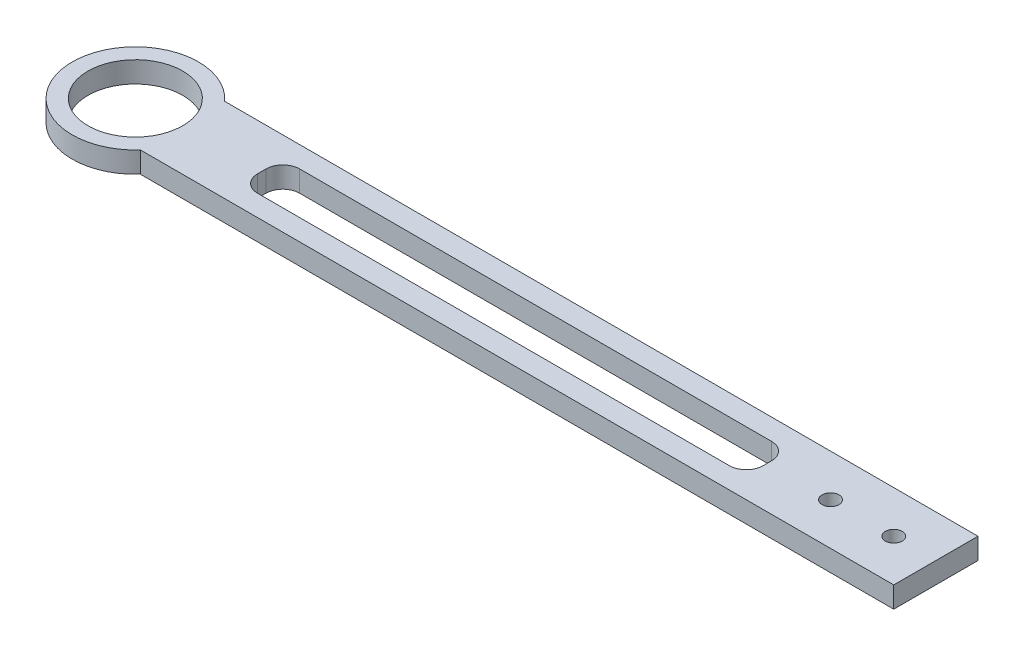
ISO-10303-21;
HEADER;
FILE_DESCRIPTION(('STEP AP214'),'2;1');
FILE_NAME('part.step','',(''),(''),'','','');
FILE_SCHEMA(('AUTOMOTIVE_DESIGN { 1 0 10303 214 1 1 1 1 }'));
ENDSEC;
DATA;
#1=APPLICATION_CONTEXT('core data for automotive mechanical design processes');
#2=APPLICATION_PROTOCOL_DEFINITION('international standard','automotive_design',2000,#1);
#3=PRODUCT_CONTEXT('',#1,'mechanical');
#4=PRODUCT('Part','Part','',(#3));
#5=PRODUCT_RELATED_PRODUCT_CATEGORY('part','',(#4));
#6=PRODUCT_DEFINITION_FORMATION('','',#4);
#7=PRODUCT_DEFINITION_CONTEXT('part definition',#1,'design');
#8=PRODUCT_DEFINITION('design','',#6,#7);
#9=PRODUCT_DEFINITION_SHAPE('','',#8);
#10=(LENGTH_UNIT() NAMED_UNIT(*) SI_UNIT(.MILLI.,.METRE.));
#11=(NAMED_UNIT(*) PLANE_ANGLE_UNIT() SI_UNIT($,.RADIAN.));
#12=(NAMED_UNIT(*) SI_UNIT($,.STERADIAN.) SOLID_ANGLE_UNIT());
#13=UNCERTAINTY_MEASURE_WITH_UNIT(LENGTH_MEASURE(1.E-05),#10,'distance_accuracy_value','');
#14=(GEOMETRIC_REPRESENTATION_CONTEXT(3) GLOBAL_UNCERTAINTY_ASSIGNED_CONTEXT((#13)) GLOBAL_UNIT_ASSIGNED_CONTEXT((#10,
#11,#12)) REPRESENTATION_CONTEXT('',''));
#15=CARTESIAN_POINT('',(0.,0.,0.));
#16=DIRECTION('',(0.,0.,1.));
#17=DIRECTION('',(1.,0.,0.));
#18=AXIS2_PLACEMENT_3D('',#15,#16,#17);
#19=CARTESIAN_POINT('',(127.,3.175,12.7));
#20=DIRECTION('',(-1.,0.,0.));
#21=DIRECTION('',(0.,0.,1.));
#22=AXIS2_PLACEMENT_3D('',#19,#20,#21);
#23=PLANE('',#22);
#24=DIRECTION('',(0.,0.,-1.));
#25=VECTOR('',#24,1.);
#26=CARTESIAN_POINT('',(127.,-3.175,12.7));
#27=LINE('',#26,#25);
#28=CARTESIAN_POINT('',(127.,-3.175,12.7));
#29=VERTEX_POINT('',#28);
#30=CARTESIAN_POINT('',(127.,-3.175,-12.7));
#31=VERTEX_POINT('',#30);
#32=EDGE_CURVE('E156',#29,#31,#27,.T.);
#33=ORIENTED_EDGE('',*,*,#32,.T.);
#34=DIRECTION('',(0.,-1.,0.));
#35=VECTOR('',#34,1.);
#36=CARTESIAN_POINT('',(127.,3.175,-12.7));
#37=LINE('',#36,#35);
#38=CARTESIAN_POINT('',(127.,3.175,-12.7));
#39=VERTEX_POINT('',#38);
#40=EDGE_CURVE('E150',#39,#31,#37,.T.);
#41=ORIENTED_EDGE('',*,*,#40,.F.);
#42=DIRECTION('',(0.,0.,-1.));
#43=VECTOR('',#42,1.);
#44=CARTESIAN_POINT('',(127.,3.175,12.7));
#45=LINE('',#44,#43);
#46=CARTESIAN_POINT('',(127.,3.175,12.7));
#47=VERTEX_POINT('',#46);
#48=EDGE_CURVE('E152',#47,#39,#45,.T.);
#49=ORIENTED_EDGE('',*,*,#48,.F.);
#50=DIRECTION('',(0.,-1.,0.));
#51=VECTOR('',#50,1.);
#52=CARTESIAN_POINT('',(127.,3.175,12.7));
#53=LINE('',#52,#51);
#54=EDGE_CURVE('E147',#47,#29,#53,.T.);
#55=ORIENTED_EDGE('',*,*,#54,.T.);
#56=EDGE_LOOP('',(#33,#41,#49,#55));
#57=FACE_BOUND('',#56,.T.);
#58=ADVANCED_FACE('F35',(#57),#23,.F.);
#59=CARTESIAN_POINT('',(-127.,3.175,-12.7));
#60=DIRECTION('',(0.,0.,1.));
#61=DIRECTION('',(1.,0.,0.));
#62=AXIS2_PLACEMENT_3D('',#59,#60,#61);
#63=PLANE('',#62);
#64=DIRECTION('',(-1.,0.,0.));
#65=VECTOR('',#64,1.);
#66=CARTESIAN_POINT('',(-127.,-3.175,-12.7));
#67=LINE('',#66,#65);
#68=CARTESIAN_POINT('',(-100.100968342876,-3.175,-12.7));
#69=VERTEX_POINT('',#68);
#70=EDGE_CURVE('E159',#31,#69,#67,.T.);
#71=ORIENTED_EDGE('',*,*,#70,.T.);
#72=DIRECTION('',(0.,-1.,0.));
#73=VECTOR('',#72,1.);
#74=CARTESIAN_POINT('',(-100.100968342876,57.0565367264149,-12.7));
#75=LINE('',#74,#73);
#76=CARTESIAN_POINT('',(-100.100968342876,3.175,-12.7));
#77=VERTEX_POINT('',#76);
#78=EDGE_CURVE('E134',#69,#77,#75,.F.);
#79=ORIENTED_EDGE('',*,*,#78,.T.);
#80=DIRECTION('',(-1.,0.,0.));
#81=VECTOR('',#80,1.);
#82=CARTESIAN_POINT('',(-127.,3.175,-12.7));
#83=LINE('',#82,#81);
#84=EDGE_CURVE('E143',#39,#77,#83,.T.);
#85=ORIENTED_EDGE('',*,*,#84,.F.);
#86=ORIENTED_EDGE('',*,*,#40,.T.);
#87=EDGE_LOOP('',(#71,#79,#85,#86));
#88=FACE_BOUND('',#87,.T.);
#89=ADVANCED_FACE('F248',(#88),#63,.F.);
#90=CARTESIAN_POINT('',(-127.,3.175,12.7));
#91=DIRECTION('',(0.,0.,-1.));
#92=DIRECTION('',(-1.,0.,0.));
#93=AXIS2_PLACEMENT_3D('',#90,#91,#92);
#94=PLANE('',#93);
#95=DIRECTION('',(1.,0.,0.));
#96=VECTOR('',#95,1.);
#97=CARTESIAN_POINT('',(-127.,3.175,12.7));
#98=LINE('',#97,#96);
#99=CARTESIAN_POINT('',(-100.100968342876,3.175,12.7));
#100=VERTEX_POINT('',#99);
#101=EDGE_CURVE('E141',#100,#47,#98,.T.);
#102=ORIENTED_EDGE('',*,*,#101,.F.);
#103=DIRECTION('',(0.,-1.,0.));
#104=VECTOR('',#103,1.);
#105=CARTESIAN_POINT('',(-100.100968342876,57.0565367264149,12.7));
#106=LINE('',#105,#104);
#107=CARTESIAN_POINT('',(-100.100968342876,-3.175,12.7));
#108=VERTEX_POINT('',#107);
#109=EDGE_CURVE('E124',#100,#108,#106,.T.);
#110=ORIENTED_EDGE('',*,*,#109,.T.);
#111=DIRECTION('',(1.,0.,0.));
#112=VECTOR('',#111,1.);
#113=CARTESIAN_POINT('',(-127.,-3.175,12.7));
#114=LINE('',#113,#112);
#115=EDGE_CURVE('E163',#108,#29,#114,.T.);
#116=ORIENTED_EDGE('',*,*,#115,.T.);
#117=ORIENTED_EDGE('',*,*,#54,.F.);
#118=EDGE_LOOP('',(#102,#110,#116,#117));
#119=FACE_BOUND('',#118,.T.);
#120=ADVANCED_FACE('F145',(#119),#94,.F.);
#121=CARTESIAN_POINT('',(0.,3.175,0.));
#122=DIRECTION('',(0.,-1.,0.));
#123=DIRECTION('',(0.,0.,-1.));
#124=AXIS2_PLACEMENT_3D('',#121,#122,#123);
#125=PLANE('',#124);
#126=CARTESIAN_POINT('',(-114.3,3.175,0.));
#127=DIRECTION('',(0.,-1.,0.));
#128=DIRECTION('',(0.,0.,-1.));
#129=AXIS2_PLACEMENT_3D('',#126,#127,#128);
#130=CIRCLE('',#129,14.2875);
#131=CARTESIAN_POINT('',(-114.3,3.175,-14.2875));
#132=VERTEX_POINT('',#131);
#133=EDGE_CURVE('E251',#132,#132,#130,.T.);
#134=ORIENTED_EDGE('',*,*,#133,.T.);
#135=EDGE_LOOP('',(#134));
#136=FACE_BOUND('',#135,.T.);
#137=ORIENTED_EDGE('',*,*,#84,.T.);
#138=CARTESIAN_POINT('',(-114.3,3.175,0.));
#139=DIRECTION('',(0.,-1.,0.));
#140=DIRECTION('',(0.,0.,-1.));
#141=AXIS2_PLACEMENT_3D('',#138,#139,#140);
#142=CIRCLE('',#141,19.05);
#143=EDGE_CURVE('E127',#77,#100,#142,.F.);
#144=ORIENTED_EDGE('',*,*,#143,.T.);
#145=ORIENTED_EDGE('',*,*,#101,.T.);
#146=ORIENTED_EDGE('',*,*,#48,.T.);
#147=EDGE_LOOP('',(#137,#144,#145,#146));
#148=FACE_BOUND('',#147,.T.);
#149=DIRECTION('',(-1.,0.,0.));
#150=VECTOR('',#149,1.);
#151=CARTESIAN_POINT('',(-76.1999999999999,3.175,-6.35));
#152=LINE('',#151,#150);
#153=CARTESIAN_POINT('',(71.1199999999999,3.175,-6.35));
#154=VERTEX_POINT('',#153);
#155=CARTESIAN_POINT('',(-71.1199999999999,3.175,-6.35));
#156=VERTEX_POINT('',#155);
#157=EDGE_CURVE('E201',#154,#156,#152,.T.);
#158=ORIENTED_EDGE('',*,*,#157,.F.);
#159=CARTESIAN_POINT('',(71.12,3.175,-1.27));
#160=DIRECTION('',(0.,-1.,0.));
#161=DIRECTION('',(0.,0.,-1.));
#162=AXIS2_PLACEMENT_3D('',#159,#160,#161);
#163=CIRCLE('',#162,5.08);
#164=CARTESIAN_POINT('',(76.2,3.175,-1.27));
#165=VERTEX_POINT('',#164);
#166=EDGE_CURVE('E43',#154,#165,#163,.T.);
#167=ORIENTED_EDGE('',*,*,#166,.T.);
#168=DIRECTION('',(0.,0.,-1.));
#169=VECTOR('',#168,1.);
#170=CARTESIAN_POINT('',(76.2,3.175,6.35));
#171=LINE('',#170,#169);
#172=CARTESIAN_POINT('',(76.2,3.175,1.27));
#173=VERTEX_POINT('',#172);
#174=EDGE_CURVE('E199',#173,#165,#171,.T.);
#175=ORIENTED_EDGE('',*,*,#174,.F.);
#176=CARTESIAN_POINT('',(71.12,3.175,1.27));
#177=DIRECTION('',(0.,-1.,0.));
#178=DIRECTION('',(0.,0.,-1.));
#179=AXIS2_PLACEMENT_3D('',#176,#177,#178);
#180=CIRCLE('',#179,5.08);
#181=CARTESIAN_POINT('',(71.1199999999999,3.175,6.35));
#182=VERTEX_POINT('',#181);
#183=EDGE_CURVE('E194',#173,#182,#180,.T.);
#184=ORIENTED_EDGE('',*,*,#183,.T.);
#185=DIRECTION('',(1.,0.,0.));
#186=VECTOR('',#185,1.);
#187=CARTESIAN_POINT('',(-76.1999999999999,3.175,6.35));
#188=LINE('',#187,#186);
#189=CARTESIAN_POINT('',(-71.1199999999999,3.175,6.35));
#190=VERTEX_POINT('',#189);
#191=EDGE_CURVE('E223',#190,#182,#188,.T.);
#192=ORIENTED_EDGE('',*,*,#191,.F.);
#193=CARTESIAN_POINT('',(-71.1199999999999,3.175,1.27));
#194=DIRECTION('',(0.,-1.,0.));
#195=DIRECTION('',(0.,0.,-1.));
#196=AXIS2_PLACEMENT_3D('',#193,#194,#195);
#197=CIRCLE('',#196,5.08);
#198=CARTESIAN_POINT('',(-76.1999999999999,3.175,1.27));
#199=VERTEX_POINT('',#198);
#200=EDGE_CURVE('E190',#190,#199,#197,.T.);
#201=ORIENTED_EDGE('',*,*,#200,.T.);
#202=DIRECTION('',(0.,0.,1.));
#203=VECTOR('',#202,1.);
#204=CARTESIAN_POINT('',(-76.1999999999999,3.175,6.35));
#205=LINE('',#204,#203);
#206=CARTESIAN_POINT('',(-76.1999999999999,3.175,-1.27));
#207=VERTEX_POINT('',#206);
#208=EDGE_CURVE('E230',#207,#199,#205,.T.);
#209=ORIENTED_EDGE('',*,*,#208,.F.);
#210=CARTESIAN_POINT('',(-71.1199999999999,3.175,-1.27));
#211=DIRECTION('',(0.,-1.,0.));
#212=DIRECTION('',(0.,0.,-1.));
#213=AXIS2_PLACEMENT_3D('',#210,#211,#212);
#214=CIRCLE('',#213,5.08);
#215=EDGE_CURVE('E186',#207,#156,#214,.T.);
#216=ORIENTED_EDGE('',*,*,#215,.T.);
#217=EDGE_LOOP('',(#158,#167,#175,#184,#192,#201,#209,#216));
#218=FACE_BOUND('',#217,.T.);
#219=CARTESIAN_POINT('',(114.3,3.175,0.));
#220=DIRECTION('',(0.,1.,0.));
#221=DIRECTION('',(0.,0.,1.));
#222=AXIS2_PLACEMENT_3D('',#219,#220,#221);
#223=CIRCLE('',#222,2.55270000000001);
#224=CARTESIAN_POINT('',(114.3,3.175,2.55269999999999));
#225=VERTEX_POINT('',#224);
#226=EDGE_CURVE('E227',#225,#225,#223,.T.);
#227=ORIENTED_EDGE('',*,*,#226,.F.);
#228=EDGE_LOOP('',(#227));
#229=FACE_BOUND('',#228,.T.);
#230=CARTESIAN_POINT('',(95.25,3.175,0.));
#231=DIRECTION('',(0.,1.,0.));
#232=DIRECTION('',(0.,0.,1.));
#233=AXIS2_PLACEMENT_3D('',#230,#231,#232);
#234=CIRCLE('',#233,2.55270000000001);
#235=CARTESIAN_POINT('',(95.25,3.175,2.55270000000001));
#236=VERTEX_POINT('',#235);
#237=EDGE_CURVE('E240',#236,#236,#234,.T.);
#238=ORIENTED_EDGE('',*,*,#237,.F.);
#239=EDGE_LOOP('',(#238));
#240=FACE_BOUND('',#239,.T.);
#241=ADVANCED_FACE('F138',(#136,#148,#218,#229,#240),#125,.F.);
#242=CARTESIAN_POINT('',(0.,-3.175,0.));
#243=DIRECTION('',(0.,-1.,0.));
#244=DIRECTION('',(0.,0.,-1.));
#245=AXIS2_PLACEMENT_3D('',#242,#243,#244);
#246=PLANE('',#245);
#247=CARTESIAN_POINT('',(-114.3,-3.175,0.));
#248=DIRECTION('',(0.,-1.,0.));
#249=DIRECTION('',(0.,0.,-1.));
#250=AXIS2_PLACEMENT_3D('',#247,#248,#249);
#251=CIRCLE('',#250,14.2875);
#252=CARTESIAN_POINT('',(-114.3,-3.175,-14.2875));
#253=VERTEX_POINT('',#252);
#254=EDGE_CURVE('E252',#253,#253,#251,.T.);
#255=ORIENTED_EDGE('',*,*,#254,.F.);
#256=EDGE_LOOP('',(#255));
#257=FACE_BOUND('',#256,.T.);
#258=CARTESIAN_POINT('',(-114.3,-3.175,0.));
#259=DIRECTION('',(0.,-1.,0.));
#260=DIRECTION('',(0.,0.,-1.));
#261=AXIS2_PLACEMENT_3D('',#258,#259,#260);
#262=CIRCLE('',#261,19.05);
#263=EDGE_CURVE('E130',#108,#69,#262,.T.);
#264=ORIENTED_EDGE('',*,*,#263,.T.);
#265=ORIENTED_EDGE('',*,*,#70,.F.);
#266=ORIENTED_EDGE('',*,*,#32,.F.);
#267=ORIENTED_EDGE('',*,*,#115,.F.);
#268=EDGE_LOOP('',(#264,#265,#266,#267));
#269=FACE_BOUND('',#268,.T.);
#270=DIRECTION('',(1.,0.,0.));
#271=VECTOR('',#270,1.);
#272=CARTESIAN_POINT('',(-76.1999999999999,-3.175,6.35));
#273=LINE('',#272,#271);
#274=CARTESIAN_POINT('',(-71.1199999999999,-3.175,6.35));
#275=VERTEX_POINT('',#274);
#276=CARTESIAN_POINT('',(71.1199999999999,-3.175,6.35));
#277=VERTEX_POINT('',#276);
#278=EDGE_CURVE('E221',#275,#277,#273,.T.);
#279=ORIENTED_EDGE('',*,*,#278,.T.);
#280=CARTESIAN_POINT('',(71.12,-3.175,1.27));
#281=DIRECTION('',(0.,-1.,0.));
#282=DIRECTION('',(0.,0.,-1.));
#283=AXIS2_PLACEMENT_3D('',#280,#281,#282);
#284=CIRCLE('',#283,5.08);
#285=CARTESIAN_POINT('',(76.2,-3.175,1.27));
#286=VERTEX_POINT('',#285);
#287=EDGE_CURVE('E57',#277,#286,#284,.F.);
#288=ORIENTED_EDGE('',*,*,#287,.T.);
#289=DIRECTION('',(0.,0.,-1.));
#290=VECTOR('',#289,1.);
#291=CARTESIAN_POINT('',(76.2,-3.175,6.35));
#292=LINE('',#291,#290);
#293=CARTESIAN_POINT('',(76.2,-3.175,-1.27));
#294=VERTEX_POINT('',#293);
#295=EDGE_CURVE('E214',#286,#294,#292,.T.);
#296=ORIENTED_EDGE('',*,*,#295,.T.);
#297=CARTESIAN_POINT('',(71.12,-3.175,-1.27));
#298=DIRECTION('',(0.,-1.,0.));
#299=DIRECTION('',(0.,0.,-1.));
#300=AXIS2_PLACEMENT_3D('',#297,#298,#299);
#301=CIRCLE('',#300,5.08);
#302=CARTESIAN_POINT('',(71.1199999999999,-3.175,-6.35));
#303=VERTEX_POINT('',#302);
#304=EDGE_CURVE('E11',#294,#303,#301,.F.);
#305=ORIENTED_EDGE('',*,*,#304,.T.);
#306=DIRECTION('',(-1.,0.,0.));
#307=VECTOR('',#306,1.);
#308=CARTESIAN_POINT('',(-76.1999999999999,-3.175,-6.35));
#309=LINE('',#308,#307);
#310=CARTESIAN_POINT('',(-71.1199999999999,-3.175,-6.35));
#311=VERTEX_POINT('',#310);
#312=EDGE_CURVE('E212',#303,#311,#309,.T.);
#313=ORIENTED_EDGE('',*,*,#312,.T.);
#314=CARTESIAN_POINT('',(-71.1199999999999,-3.175,-1.27));
#315=DIRECTION('',(0.,-1.,0.));
#316=DIRECTION('',(0.,0.,-1.));
#317=AXIS2_PLACEMENT_3D('',#314,#315,#316);
#318=CIRCLE('',#317,5.08);
#319=CARTESIAN_POINT('',(-76.1999999999999,-3.175,-1.27));
#320=VERTEX_POINT('',#319);
#321=EDGE_CURVE('E188',#311,#320,#318,.F.);
#322=ORIENTED_EDGE('',*,*,#321,.T.);
#323=DIRECTION('',(0.,0.,1.));
#324=VECTOR('',#323,1.);
#325=CARTESIAN_POINT('',(-76.1999999999999,-3.175,6.35));
#326=LINE('',#325,#324);
#327=CARTESIAN_POINT('',(-76.1999999999999,-3.175,1.27));
#328=VERTEX_POINT('',#327);
#329=EDGE_CURVE('E218',#320,#328,#326,.T.);
#330=ORIENTED_EDGE('',*,*,#329,.T.);
#331=CARTESIAN_POINT('',(-71.1199999999999,-3.175,1.27));
#332=DIRECTION('',(0.,-1.,0.));
#333=DIRECTION('',(0.,0.,-1.));
#334=AXIS2_PLACEMENT_3D('',#331,#332,#333);
#335=CIRCLE('',#334,5.08);
#336=EDGE_CURVE('E192',#328,#275,#335,.F.);
#337=ORIENTED_EDGE('',*,*,#336,.T.);
#338=EDGE_LOOP('',(#279,#288,#296,#305,#313,#322,#330,#337));
#339=FACE_BOUND('',#338,.T.);
#340=CARTESIAN_POINT('',(114.3,-3.175,0.));
#341=DIRECTION('',(0.,1.,0.));
#342=DIRECTION('',(0.,0.,1.));
#343=AXIS2_PLACEMENT_3D('',#340,#341,#342);
#344=CIRCLE('',#343,2.55270000000001);
#345=CARTESIAN_POINT('',(114.3,-3.175,2.55269999999999));
#346=VERTEX_POINT('',#345);
#347=EDGE_CURVE('E237',#346,#346,#344,.T.);
#348=ORIENTED_EDGE('',*,*,#347,.T.);
#349=EDGE_LOOP('',(#348));
#350=FACE_BOUND('',#349,.T.);
#351=CARTESIAN_POINT('',(95.25,-3.175,0.));
#352=DIRECTION('',(0.,1.,0.));
#353=DIRECTION('',(0.,0.,1.));
#354=AXIS2_PLACEMENT_3D('',#351,#352,#353);
#355=CIRCLE('',#354,2.55270000000001);
#356=CARTESIAN_POINT('',(95.25,-3.175,2.55270000000001));
#357=VERTEX_POINT('',#356);
#358=EDGE_CURVE('E160',#357,#357,#355,.T.);
#359=ORIENTED_EDGE('',*,*,#358,.T.);
#360=EDGE_LOOP('',(#359));
#361=FACE_BOUND('',#360,.T.);
#362=ADVANCED_FACE('F210',(#257,#269,#339,#350,#361),#246,.T.);
#363=CARTESIAN_POINT('',(95.25,3.175,0.));
#364=DIRECTION('',(0.,1.,0.));
#365=DIRECTION('',(0.,0.,1.));
#366=AXIS2_PLACEMENT_3D('',#363,#364,#365);
#367=CYLINDRICAL_SURFACE('',#366,2.55270000000001);
#368=ORIENTED_EDGE('',*,*,#358,.F.);
#369=EDGE_LOOP('',(#368));
#370=FACE_BOUND('',#369,.T.);
#371=ORIENTED_EDGE('',*,*,#237,.T.);
#372=EDGE_LOOP('',(#371));
#373=FACE_BOUND('',#372,.T.);
#374=ADVANCED_FACE('F267',(#370,#373),#367,.F.);
#375=CARTESIAN_POINT('',(114.3,3.175,0.));
#376=DIRECTION('',(0.,1.,0.));
#377=DIRECTION('',(0.,0.,1.));
#378=AXIS2_PLACEMENT_3D('',#375,#376,#377);
#379=CYLINDRICAL_SURFACE('',#378,2.55270000000001);
#380=ORIENTED_EDGE('',*,*,#347,.F.);
#381=EDGE_LOOP('',(#380));
#382=FACE_BOUND('',#381,.T.);
#383=ORIENTED_EDGE('',*,*,#226,.T.);
#384=EDGE_LOOP('',(#383));
#385=FACE_BOUND('',#384,.T.);
#386=ADVANCED_FACE('F273',(#382,#385),#379,.F.);
#387=CARTESIAN_POINT('',(76.2,-3.175,6.35));
#388=DIRECTION('',(1.,0.,0.));
#389=DIRECTION('',(0.,0.,-1.));
#390=AXIS2_PLACEMENT_3D('',#387,#388,#389);
#391=PLANE('',#390);
#392=ORIENTED_EDGE('',*,*,#295,.F.);
#393=DIRECTION('',(0.,1.,0.));
#394=VECTOR('',#393,1.);
#395=CARTESIAN_POINT('',(76.2,3.175,1.27));
#396=LINE('',#395,#394);
#397=EDGE_CURVE('E183',#286,#173,#396,.T.);
#398=ORIENTED_EDGE('',*,*,#397,.T.);
#399=ORIENTED_EDGE('',*,*,#174,.T.);
#400=DIRECTION('',(0.,1.,0.));
#401=VECTOR('',#400,1.);
#402=CARTESIAN_POINT('',(76.2,-3.175,-1.27));
#403=LINE('',#402,#401);
#404=EDGE_CURVE('E50',#165,#294,#403,.F.);
#405=ORIENTED_EDGE('',*,*,#404,.T.);
#406=EDGE_LOOP('',(#392,#398,#399,#405));
#407=FACE_BOUND('',#406,.T.);
#408=ADVANCED_FACE('F204',(#407),#391,.F.);
#409=CARTESIAN_POINT('',(-76.1999999999999,-3.175,6.35));
#410=DIRECTION('',(0.,0.,1.));
#411=DIRECTION('',(1.,0.,0.));
#412=AXIS2_PLACEMENT_3D('',#409,#410,#411);
#413=PLANE('',#412);
#414=ORIENTED_EDGE('',*,*,#278,.F.);
#415=DIRECTION('',(0.,1.,0.));
#416=VECTOR('',#415,1.);
#417=CARTESIAN_POINT('',(-71.1199999999999,3.175,6.35));
#418=LINE('',#417,#416);
#419=EDGE_CURVE('E179',#275,#190,#418,.T.);
#420=ORIENTED_EDGE('',*,*,#419,.T.);
#421=ORIENTED_EDGE('',*,*,#191,.T.);
#422=DIRECTION('',(0.,1.,0.));
#423=VECTOR('',#422,1.);
#424=CARTESIAN_POINT('',(71.12,-3.175,6.35));
#425=LINE('',#424,#423);
#426=EDGE_CURVE('E177',#182,#277,#425,.F.);
#427=ORIENTED_EDGE('',*,*,#426,.T.);
#428=EDGE_LOOP('',(#414,#420,#421,#427));
#429=FACE_BOUND('',#428,.T.);
#430=ADVANCED_FACE('F302',(#429),#413,.F.);
#431=CARTESIAN_POINT('',(-76.1999999999999,-3.175,6.35));
#432=DIRECTION('',(-1.,0.,0.));
#433=DIRECTION('',(0.,0.,1.));
#434=AXIS2_PLACEMENT_3D('',#431,#432,#433);
#435=PLANE('',#434);
#436=ORIENTED_EDGE('',*,*,#329,.F.);
#437=DIRECTION('',(0.,1.,0.));
#438=VECTOR('',#437,1.);
#439=CARTESIAN_POINT('',(-76.1999999999999,3.175,-1.27));
#440=LINE('',#439,#438);
#441=EDGE_CURVE('E169',#320,#207,#440,.T.);
#442=ORIENTED_EDGE('',*,*,#441,.T.);
#443=ORIENTED_EDGE('',*,*,#208,.T.);
#444=DIRECTION('',(0.,1.,0.));
#445=VECTOR('',#444,1.);
#446=CARTESIAN_POINT('',(-76.1999999999999,-3.175,1.27));
#447=LINE('',#446,#445);
#448=EDGE_CURVE('E167',#199,#328,#447,.F.);
#449=ORIENTED_EDGE('',*,*,#448,.T.);
#450=EDGE_LOOP('',(#436,#442,#443,#449));
#451=FACE_BOUND('',#450,.T.);
#452=ADVANCED_FACE('F309',(#451),#435,.F.);
#453=CARTESIAN_POINT('',(-76.1999999999999,-3.175,-6.35));
#454=DIRECTION('',(0.,0.,-1.));
#455=DIRECTION('',(-1.,0.,0.));
#456=AXIS2_PLACEMENT_3D('',#453,#454,#455);
#457=PLANE('',#456);
#458=ORIENTED_EDGE('',*,*,#157,.T.);
#459=DIRECTION('',(0.,1.,0.));
#460=VECTOR('',#459,1.);
#461=CARTESIAN_POINT('',(-71.1199999999999,-3.175,-6.35));
#462=LINE('',#461,#460);
#463=EDGE_CURVE('E175',#156,#311,#462,.F.);
#464=ORIENTED_EDGE('',*,*,#463,.T.);
#465=ORIENTED_EDGE('',*,*,#312,.F.);
#466=DIRECTION('',(0.,1.,0.));
#467=VECTOR('',#466,1.);
#468=CARTESIAN_POINT('',(71.12,3.175,-6.35));
#469=LINE('',#468,#467);
#470=EDGE_CURVE('E172',#303,#154,#469,.T.);
#471=ORIENTED_EDGE('',*,*,#470,.T.);
#472=EDGE_LOOP('',(#458,#464,#465,#471));
#473=FACE_BOUND('',#472,.T.);
#474=ADVANCED_FACE('F216',(#473),#457,.F.);
#475=CARTESIAN_POINT('',(-71.1199999999999,-3.175,-1.27));
#476=DIRECTION('',(0.,-1.,0.));
#477=DIRECTION('',(0.,0.,-1.));
#478=AXIS2_PLACEMENT_3D('',#475,#476,#477);
#479=CYLINDRICAL_SURFACE('',#478,5.08);
#480=ORIENTED_EDGE('',*,*,#321,.F.);
#481=ORIENTED_EDGE('',*,*,#463,.F.);
#482=ORIENTED_EDGE('',*,*,#215,.F.);
#483=ORIENTED_EDGE('',*,*,#441,.F.);
#484=EDGE_LOOP('',(#480,#481,#482,#483));
#485=FACE_BOUND('',#484,.T.);
#486=ADVANCED_FACE('F285',(#485),#479,.F.);
#487=CARTESIAN_POINT('',(-71.1199999999999,-3.175,1.27));
#488=DIRECTION('',(0.,-1.,0.));
#489=DIRECTION('',(0.,0.,-1.));
#490=AXIS2_PLACEMENT_3D('',#487,#488,#489);
#491=CYLINDRICAL_SURFACE('',#490,5.08);
#492=ORIENTED_EDGE('',*,*,#336,.F.);
#493=ORIENTED_EDGE('',*,*,#448,.F.);
#494=ORIENTED_EDGE('',*,*,#200,.F.);
#495=ORIENTED_EDGE('',*,*,#419,.F.);
#496=EDGE_LOOP('',(#492,#493,#494,#495));
#497=FACE_BOUND('',#496,.T.);
#498=ADVANCED_FACE('F288',(#497),#491,.F.);
#499=CARTESIAN_POINT('',(71.12,-3.175,1.27));
#500=DIRECTION('',(0.,-1.,0.));
#501=DIRECTION('',(0.,0.,-1.));
#502=AXIS2_PLACEMENT_3D('',#499,#500,#501);
#503=CYLINDRICAL_SURFACE('',#502,5.08);
#504=ORIENTED_EDGE('',*,*,#287,.F.);
#505=ORIENTED_EDGE('',*,*,#426,.F.);
#506=ORIENTED_EDGE('',*,*,#183,.F.);
#507=ORIENTED_EDGE('',*,*,#397,.F.);
#508=EDGE_LOOP('',(#504,#505,#506,#507));
#509=FACE_BOUND('',#508,.T.);
#510=ADVANCED_FACE('F291',(#509),#503,.F.);
#511=CARTESIAN_POINT('',(71.12,-3.175,-1.27));
#512=DIRECTION('',(0.,-1.,0.));
#513=DIRECTION('',(0.,0.,-1.));
#514=AXIS2_PLACEMENT_3D('',#511,#512,#513);
#515=CYLINDRICAL_SURFACE('',#514,5.08);
#516=ORIENTED_EDGE('',*,*,#304,.F.);
#517=ORIENTED_EDGE('',*,*,#404,.F.);
#518=ORIENTED_EDGE('',*,*,#166,.F.);
#519=ORIENTED_EDGE('',*,*,#470,.F.);
#520=EDGE_LOOP('',(#516,#517,#518,#519));
#521=FACE_BOUND('',#520,.T.);
#522=ADVANCED_FACE('F37',(#521),#515,.F.);
#523=CARTESIAN_POINT('',(-114.3,57.0565367264149,0.));
#524=DIRECTION('',(0.,-1.,0.));
#525=DIRECTION('',(0.,0.,-1.));
#526=AXIS2_PLACEMENT_3D('',#523,#524,#525);
#527=CYLINDRICAL_SURFACE('',#526,19.05);
#528=ORIENTED_EDGE('',*,*,#78,.F.);
#529=ORIENTED_EDGE('',*,*,#263,.F.);
#530=ORIENTED_EDGE('',*,*,#109,.F.);
#531=ORIENTED_EDGE('',*,*,#143,.F.);
#532=EDGE_LOOP('',(#528,#529,#530,#531));
#533=FACE_BOUND('',#532,.T.);
#534=ADVANCED_FACE('F126',(#533),#527,.T.);
#535=CARTESIAN_POINT('',(-114.3,3.175,0.));
#536=DIRECTION('',(0.,-1.,0.));
#537=DIRECTION('',(0.,0.,-1.));
#538=AXIS2_PLACEMENT_3D('',#535,#536,#537);
#539=CYLINDRICAL_SURFACE('',#538,14.2875);
#540=ORIENTED_EDGE('',*,*,#133,.F.);
#541=EDGE_LOOP('',(#540));
#542=FACE_BOUND('',#541,.T.);
#543=ORIENTED_EDGE('',*,*,#254,.T.);
#544=EDGE_LOOP('',(#543));
#545=FACE_BOUND('',#544,.T.);
#546=ADVANCED_FACE('F259',(#542,#545),#539,.F.);
#547=CLOSED_SHELL('',(#58,#89,#120,#241,#362,#374,#386,#408,#430,#452,#474,#486,#498,#510,#522,
#534,#546));
#548=MANIFOLD_SOLID_BREP('B2',#547);
#549=ADVANCED_BREP_SHAPE_REPRESENTATION('',(#18,#548),#14);
#550=SHAPE_DEFINITION_REPRESENTATION(#9,#549);
ENDSEC;
END-ISO-10303-21;
